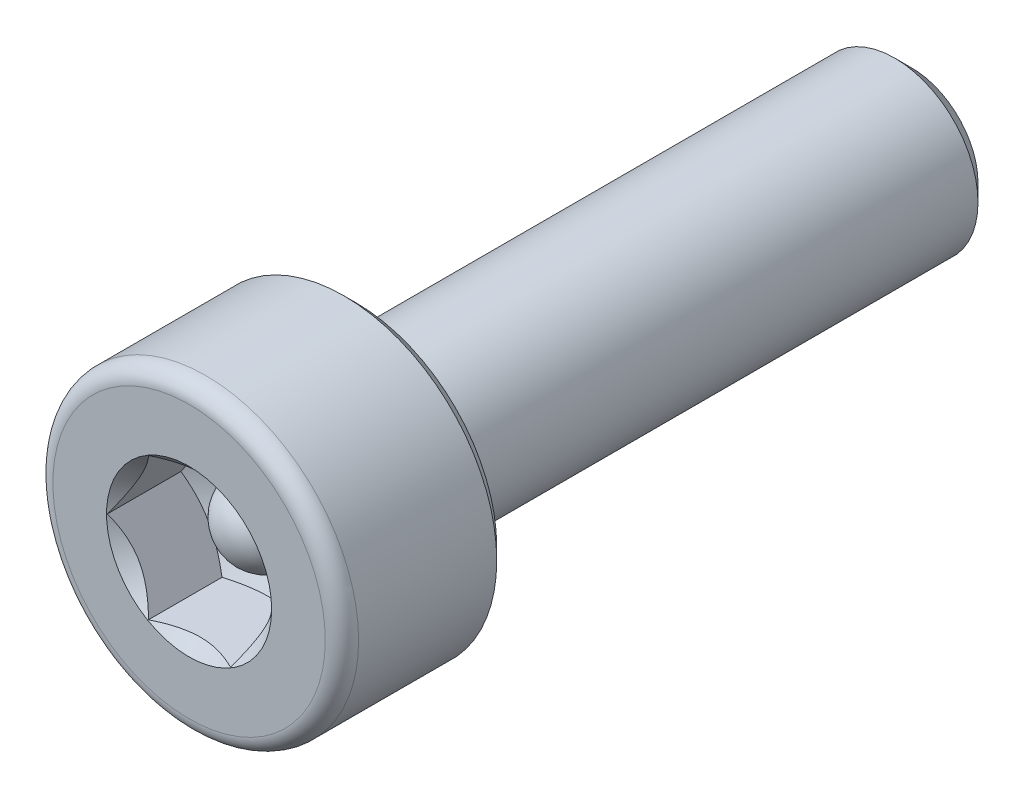
ISO-10303-21;
HEADER;
FILE_DESCRIPTION(('STEP AP214'),'2;1');
FILE_NAME('part.step','',(''),(''),'','','');
FILE_SCHEMA(('AUTOMOTIVE_DESIGN { 1 0 10303 214 1 1 1 1 }'));
ENDSEC;
DATA;
#1=APPLICATION_CONTEXT('core data for automotive mechanical design processes');
#2=APPLICATION_PROTOCOL_DEFINITION('international standard','automotive_design',2000,#1);
#3=PRODUCT_CONTEXT('',#1,'mechanical');
#4=PRODUCT('Part','Part','',(#3));
#5=PRODUCT_RELATED_PRODUCT_CATEGORY('part','',(#4));
#6=PRODUCT_DEFINITION_FORMATION('','',#4);
#7=PRODUCT_DEFINITION_CONTEXT('part definition',#1,'design');
#8=PRODUCT_DEFINITION('design','',#6,#7);
#9=PRODUCT_DEFINITION_SHAPE('','',#8);
#10=(LENGTH_UNIT() NAMED_UNIT(*) SI_UNIT(.MILLI.,.METRE.));
#11=(NAMED_UNIT(*) PLANE_ANGLE_UNIT() SI_UNIT($,.RADIAN.));
#12=(NAMED_UNIT(*) SI_UNIT($,.STERADIAN.) SOLID_ANGLE_UNIT());
#13=UNCERTAINTY_MEASURE_WITH_UNIT(LENGTH_MEASURE(1.E-05),#10,'distance_accuracy_value','');
#14=(GEOMETRIC_REPRESENTATION_CONTEXT(3) GLOBAL_UNCERTAINTY_ASSIGNED_CONTEXT((#13)) GLOBAL_UNIT_ASSIGNED_CONTEXT((#10,
#11,#12)) REPRESENTATION_CONTEXT('',''));
#15=CARTESIAN_POINT('',(0.,0.,0.));
#16=DIRECTION('',(0.,0.,1.));
#17=DIRECTION('',(1.,0.,0.));
#18=AXIS2_PLACEMENT_3D('',#15,#16,#17);
#19=CARTESIAN_POINT('',(0.,0.,1.615850938766));
#20=DIRECTION('',(1.,0.,0.));
#21=DIRECTION('',(0.,-1.,0.));
#22=AXIS2_PLACEMENT_3D('',#19,#20,#21);
#23=SPHERICAL_SURFACE('',#22,0.739008344563);
#24=CARTESIAN_POINT('',(0.739008344562999,0.,1.615850938766));
#25=VERTEX_POINT('',#24);
#26=VERTEX_LOOP('',#25);
#27=FACE_BOUND('',#26,.T.);
#28=CARTESIAN_POINT('',(-0.739008344563001,0.,1.615850938766));
#29=VERTEX_POINT('',#28);
#30=VERTEX_LOOP('',#29);
#31=FACE_BOUND('',#30,.T.);
#32=ADVANCED_FACE('P0_F16',(#27,#31),#23,.T.);
#33=CLOSED_SHELL('',(#32));
#34=MANIFOLD_SOLID_BREP('P0_B1',#33);
#35=CARTESIAN_POINT('',(0.,0.,-0.1));
#36=DIRECTION('',(0.,0.,-1.));
#37=DIRECTION('',(-1.,0.,0.));
#38=AXIS2_PLACEMENT_3D('',#35,#36,#37);
#39=CYLINDRICAL_SURFACE('',#38,1.5);
#40=CARTESIAN_POINT('',(0.,0.,-9.693282669493));
#41=DIRECTION('',(0.,0.,-1.));
#42=DIRECTION('',(-1.,0.,0.));
#43=AXIS2_PLACEMENT_3D('',#40,#41,#42);
#44=CIRCLE('',#43,1.5);
#45=CARTESIAN_POINT('',(-1.5,0.,-9.693282669493));
#46=VERTEX_POINT('',#45);
#47=EDGE_CURVE('P1_E30',#46,#46,#44,.F.);
#48=ORIENTED_EDGE('',*,*,#47,.T.);
#49=EDGE_LOOP('',(#48));
#50=FACE_BOUND('',#49,.T.);
#51=CARTESIAN_POINT('',(0.,0.,-0.1));
#52=DIRECTION('',(0.,0.,-1.));
#53=DIRECTION('',(-1.,0.,0.));
#54=AXIS2_PLACEMENT_3D('',#51,#52,#53);
#55=CIRCLE('',#54,1.5);
#56=CARTESIAN_POINT('',(-1.5,0.,-0.1));
#57=VERTEX_POINT('',#56);
#58=EDGE_CURVE('P1_E11',#57,#57,#55,.T.);
#59=ORIENTED_EDGE('',*,*,#58,.T.);
#60=EDGE_LOOP('',(#59));
#61=FACE_BOUND('',#60,.T.);
#62=ADVANCED_FACE('P1_F17',(#50,#61),#39,.T.);
#63=CARTESIAN_POINT('',(0.,0.,-0.1));
#64=DIRECTION('',(0.,0.,-1.));
#65=DIRECTION('',(1.,0.,0.));
#66=AXIS2_PLACEMENT_3D('',#63,#64,#65);
#67=TOROIDAL_SURFACE('',#66,1.6,0.1);
#68=ORIENTED_EDGE('',*,*,#58,.F.);
#69=EDGE_LOOP('',(#68));
#70=FACE_BOUND('',#69,.T.);
#71=CARTESIAN_POINT('',(0.,0.,0.));
#72=DIRECTION('',(0.,0.,-1.));
#73=DIRECTION('',(1.,0.,0.));
#74=AXIS2_PLACEMENT_3D('',#71,#72,#73);
#75=CIRCLE('',#74,1.6);
#76=CARTESIAN_POINT('',(1.6,0.,0.));
#77=VERTEX_POINT('',#76);
#78=EDGE_CURVE('P1_E123',#77,#77,#75,.F.);
#79=ORIENTED_EDGE('',*,*,#78,.F.);
#80=EDGE_LOOP('',(#79));
#81=FACE_BOUND('',#80,.T.);
#82=ADVANCED_FACE('P1_F287',(#70,#81),#67,.F.);
#83=CARTESIAN_POINT('',(0.,0.,-9.69328266961611));
#84=DIRECTION('',(0.,0.,1.));
#85=DIRECTION('',(1.,0.,0.));
#86=AXIS2_PLACEMENT_3D('',#83,#84,#85);
#87=CONICAL_SURFACE('',#86,1.49999999990769,0.785398163397448);
#88=CARTESIAN_POINT('',(0.,0.,-9.99999999999091));
#89=DIRECTION('',(0.,0.,1.));
#90=DIRECTION('',(1.,0.,0.));
#91=AXIS2_PLACEMENT_3D('',#88,#89,#90);
#92=CIRCLE('',#91,1.19328266953289);
#93=CARTESIAN_POINT('',(1.19328266953289,0.,-9.99999999999091));
#94=VERTEX_POINT('',#93);
#95=EDGE_CURVE('P1_E120',#94,#94,#92,.T.);
#96=ORIENTED_EDGE('',*,*,#95,.T.);
#97=EDGE_LOOP('',(#96));
#98=FACE_BOUND('',#97,.T.);
#99=ORIENTED_EDGE('',*,*,#47,.F.);
#100=EDGE_LOOP('',(#99));
#101=FACE_BOUND('',#100,.T.);
#102=ADVANCED_FACE('P1_F279',(#98,#101),#87,.T.);
#103=CARTESIAN_POINT('',(0.,0.,0.));
#104=DIRECTION('',(0.,0.,1.));
#105=DIRECTION('',(1.,0.,0.));
#106=AXIS2_PLACEMENT_3D('',#103,#104,#105);
#107=PLANE('',#106);
#108=ORIENTED_EDGE('',*,*,#78,.T.);
#109=EDGE_LOOP('',(#108));
#110=FACE_BOUND('',#109,.T.);
#111=CARTESIAN_POINT('',(0.,0.,0.));
#112=DIRECTION('',(0.,0.,1.));
#113=DIRECTION('',(1.,0.,0.));
#114=AXIS2_PLACEMENT_3D('',#111,#112,#113);
#115=CIRCLE('',#114,2.5349999999662);
#116=CARTESIAN_POINT('',(2.5349999999662,0.,0.));
#117=VERTEX_POINT('',#116);
#118=EDGE_CURVE('P1_E124',#117,#117,#115,.T.);
#119=ORIENTED_EDGE('',*,*,#118,.F.);
#120=EDGE_LOOP('',(#119));
#121=FACE_BOUND('',#120,.T.);
#122=ADVANCED_FACE('P1_F271',(#110,#121),#107,.F.);
#123=CARTESIAN_POINT('',(0.,0.,-10.));
#124=DIRECTION('',(0.,0.,1.));
#125=DIRECTION('',(1.,0.,0.));
#126=AXIS2_PLACEMENT_3D('',#123,#124,#125);
#127=PLANE('',#126);
#128=ORIENTED_EDGE('',*,*,#95,.F.);
#129=EDGE_LOOP('',(#128));
#130=FACE_BOUND('',#129,.T.);
#131=ADVANCED_FACE('P1_F263',(#130),#127,.F.);
#132=CARTESIAN_POINT('',(0.,0.,0.215000000025611));
#133=DIRECTION('',(0.,0.,1.));
#134=DIRECTION('',(1.,0.,0.));
#135=AXIS2_PLACEMENT_3D('',#132,#133,#134);
#136=CONICAL_SURFACE('',#135,2.74999999993497,0.785398163265254);
#137=ORIENTED_EDGE('',*,*,#118,.T.);
#138=EDGE_LOOP('',(#137));
#139=FACE_BOUND('',#138,.T.);
#140=CARTESIAN_POINT('',(0.,0.,0.215000000025611));
#141=DIRECTION('',(0.,0.,1.));
#142=DIRECTION('',(1.,0.,0.));
#143=AXIS2_PLACEMENT_3D('',#140,#141,#142);
#144=CIRCLE('',#143,2.74999999993497);
#145=CARTESIAN_POINT('',(2.74999999993497,0.,0.215000000025611));
#146=VERTEX_POINT('',#145);
#147=EDGE_CURVE('P1_E127',#146,#146,#144,.F.);
#148=ORIENTED_EDGE('',*,*,#147,.T.);
#149=EDGE_LOOP('',(#148));
#150=FACE_BOUND('',#149,.T.);
#151=ADVANCED_FACE('P1_F255',(#139,#150),#136,.T.);
#152=CARTESIAN_POINT('',(0.,0.,2.7));
#153=DIRECTION('',(0.,0.,-1.));
#154=DIRECTION('',(-1.,0.,0.));
#155=AXIS2_PLACEMENT_3D('',#152,#153,#154);
#156=CYLINDRICAL_SURFACE('',#155,2.75);
#157=ORIENTED_EDGE('',*,*,#147,.F.);
#158=EDGE_LOOP('',(#157));
#159=FACE_BOUND('',#158,.T.);
#160=CARTESIAN_POINT('',(0.,0.,2.7));
#161=DIRECTION('',(0.,0.,-1.));
#162=DIRECTION('',(-1.,0.,0.));
#163=AXIS2_PLACEMENT_3D('',#160,#161,#162);
#164=CIRCLE('',#163,2.75);
#165=CARTESIAN_POINT('',(-2.75,0.,2.7));
#166=VERTEX_POINT('',#165);
#167=EDGE_CURVE('P1_E434',#166,#166,#164,.T.);
#168=ORIENTED_EDGE('',*,*,#167,.T.);
#169=EDGE_LOOP('',(#168));
#170=FACE_BOUND('',#169,.T.);
#171=ADVANCED_FACE('P1_F248',(#159,#170),#156,.T.);
#172=CARTESIAN_POINT('',(0.,0.,2.7));
#173=DIRECTION('',(0.,0.,-1.));
#174=DIRECTION('',(1.,0.,0.));
#175=AXIS2_PLACEMENT_3D('',#172,#173,#174);
#176=TOROIDAL_SURFACE('',#175,2.45,0.3);
#177=ORIENTED_EDGE('',*,*,#167,.F.);
#178=EDGE_LOOP('',(#177));
#179=FACE_BOUND('',#178,.T.);
#180=CARTESIAN_POINT('',(0.,0.,3.));
#181=DIRECTION('',(0.,0.,-1.));
#182=DIRECTION('',(1.,0.,0.));
#183=AXIS2_PLACEMENT_3D('',#180,#181,#182);
#184=CIRCLE('',#183,2.45);
#185=CARTESIAN_POINT('',(2.45,0.,3.));
#186=VERTEX_POINT('',#185);
#187=EDGE_CURVE('P1_E131',#186,#186,#184,.F.);
#188=ORIENTED_EDGE('',*,*,#187,.F.);
#189=EDGE_LOOP('',(#188));
#190=FACE_BOUND('',#189,.T.);
#191=ADVANCED_FACE('P1_F241',(#179,#190),#176,.T.);
#192=CARTESIAN_POINT('',(0.,0.,3.));
#193=DIRECTION('',(0.,0.,1.));
#194=DIRECTION('',(1.,0.,0.));
#195=AXIS2_PLACEMENT_3D('',#192,#193,#194);
#196=PLANE('',#195);
#197=ORIENTED_EDGE('',*,*,#187,.T.);
#198=EDGE_LOOP('',(#197));
#199=FACE_BOUND('',#198,.T.);
#200=CARTESIAN_POINT('',(0.,0.,2.9999999999859));
#201=DIRECTION('',(0.,0.,1.));
#202=DIRECTION('',(1.,0.,0.));
#203=AXIS2_PLACEMENT_3D('',#200,#201,#202);
#204=CIRCLE('',#203,1.4854439087344);
#205=CARTESIAN_POINT('',(1.4854439087344,0.,2.9999999999859));
#206=VERTEX_POINT('',#205);
#207=EDGE_CURVE('P1_E128',#206,#206,#204,.F.);
#208=ORIENTED_EDGE('',*,*,#207,.T.);
#209=EDGE_LOOP('',(#208));
#210=FACE_BOUND('',#209,.T.);
#211=ADVANCED_FACE('P1_F150',(#199,#210),#196,.T.);
#212=CARTESIAN_POINT('',(0.,0.,2.9999999999859));
#213=DIRECTION('',(0.,0.,1.));
#214=DIRECTION('',(1.,0.,0.));
#215=AXIS2_PLACEMENT_3D('',#212,#213,#214);
#216=CONICAL_SURFACE('',#215,1.4854439087344,0.785398163397448);
#217=ORIENTED_EDGE('',*,*,#207,.F.);
#218=EDGE_LOOP('',(#217));
#219=FACE_BOUND('',#218,.T.);
#220=CARTESIAN_POINT('',(-0.73900833039765,1.28000002453511,2.99257279454244));
#221=CARTESIAN_POINT('',(-0.764408407762743,1.23600580002261,2.96719708967992));
#222=CARTESIAN_POINT('',(-0.790233176713147,1.1912759881068,2.94331199094595));
#223=CARTESIAN_POINT('',(-0.842892530835464,1.10006731127323,2.89957939484165));
#224=CARTESIAN_POINT('',(-0.869732121178957,1.05357977714399,2.87975622232529));
#225=CARTESIAN_POINT('',(-0.923852835173947,0.959839950762814,2.84579898979231));
#226=CARTESIAN_POINT('',(-0.951120183396313,0.912611518254027,2.83157960268337));
#227=CARTESIAN_POINT('',(-1.0062550176399,0.817115184077292,2.80967194523321));
#228=CARTESIAN_POINT('',(-1.03412082054732,0.768850197647962,2.80196732772804));
#229=CARTESIAN_POINT('',(-1.08215006859365,0.685661099782431,2.79501535623299));
#230=CARTESIAN_POINT('',(-1.10225153047865,0.650844346491229,2.79398660559318));
#231=CARTESIAN_POINT('',(-1.14241907185677,0.581272124009232,2.79572259922399));
#232=CARTESIAN_POINT('',(-1.16248514255375,0.546516670053808,2.79848818146684));
#233=CARTESIAN_POINT('',(-1.20242355510745,0.477341310337187,2.80765297004438));
#234=CARTESIAN_POINT('',(-1.22229569931528,0.442921746913913,2.814055555235));
#235=CARTESIAN_POINT('',(-1.26170819927281,0.374657294534199,2.83014952360517));
#236=CARTESIAN_POINT('',(-1.28124840886902,0.340812658723032,2.83984231799677));
#237=CARTESIAN_POINT('',(-1.3312711614295,0.254170709753885,2.86859538704998));
#238=CARTESIAN_POINT('',(-1.3614389218517,0.201918615952088,2.88981369969133));
#239=CARTESIAN_POINT('',(-1.42059417461341,0.0994587126342785,2.93760802816772));
#240=CARTESIAN_POINT('',(-1.44958514902605,0.0492448719906812,2.9641666033907));
#241=CARTESIAN_POINT('',(-1.47801665262797,6.32166031965428E-08,2.99257274387948));
#242=B_SPLINE_CURVE_WITH_KNOTS('',3,(#220,#221,#222,#223,#224,#225,#226,#227,#228,#229,#230,
#231,#232,#233,#234,#235,#236,#237,#238,#239,#240,#241),.UNSPECIFIED.,.F.,.F.,(4,2,2,2,2,2,2,2,
2,2,4),(0.,0.170474178045342,0.341941186072123,0.510685878115575,0.679005880861947,
0.799483496257406,0.919987723220984,1.04060408478872,1.16127224573515,1.35282268707442,
1.54375742347498),.UNSPECIFIED.);
#243=CARTESIAN_POINT('',(-0.739008307823175,1.28,2.99257276200718));
#244=VERTEX_POINT('',#243);
#245=CARTESIAN_POINT('',(-1.47801667075188,3.18241214037053E-08,2.99257276200339));
#246=VERTEX_POINT('',#245);
#247=EDGE_CURVE('P1_E39',#244,#246,#242,.T.);
#248=ORIENTED_EDGE('',*,*,#247,.F.);
#249=CARTESIAN_POINT('',(0.739008272408615,1.28000000611594,2.99257274094721));
#250=CARTESIAN_POINT('',(0.68820812271924,1.28000000220067,2.96719704334762));
#251=CARTESIAN_POINT('',(0.636558590484336,1.28000000059091,2.94331195077126));
#252=CARTESIAN_POINT('',(0.531239894532556,1.27999999940565,2.89957936559875));
#253=CARTESIAN_POINT('',(0.477560720480202,1.27999999984207,2.87975619784138));
#254=CARTESIAN_POINT('',(0.36931930596067,1.28000000015542,2.8457989740032));
#255=CARTESIAN_POINT('',(0.314784616340694,1.28000000004114,2.83157959085405));
#256=CARTESIAN_POINT('',(0.204514962005421,1.27999999995897,2.80967193977415));
#257=CARTESIAN_POINT('',(0.148783363515357,1.27999999999072,2.80196732468796));
#258=CARTESIAN_POINT('',(0.0527248750780999,1.28000000000665,2.7950153553539));
#259=CARTESIAN_POINT('',(0.0125219515476332,1.28000000000178,2.79398660539414));
#260=CARTESIAN_POINT('',(-0.0678131306698073,1.27999999999822,2.79572260032543));
#261=CARTESIAN_POINT('',(-0.107945271764466,1.27999999999952,2.79848818318913));
#262=CARTESIAN_POINT('',(-0.187822096259196,1.28000000000048,2.80765297292113));
#263=CARTESIAN_POINT('',(-0.22756638436111,1.28000000000013,2.8140555586481));
#264=CARTESIAN_POINT('',(-0.306391383623089,1.27999999999987,2.83014952798809));
#265=CARTESIAN_POINT('',(-0.34547180247616,1.27999999999996,2.83984232281309));
#266=CARTESIAN_POINT('',(-0.445517304080994,1.28000000000007,2.86859539209757));
#267=CARTESIAN_POINT('',(-0.505852821834525,1.28000000000004,2.88981370415139));
#268=CARTESIAN_POINT('',(-0.624163321317431,1.27999999999997,2.93760803081388));
#269=CARTESIAN_POINT('',(-0.682145267195326,1.27999999999993,2.96416660480513));
#270=CARTESIAN_POINT('',(-0.73900827158237,1.28,2.99257274388677));
#271=B_SPLINE_CURVE_WITH_KNOTS('',3,(#249,#250,#251,#252,#253,#254,#255,#256,#257,#258,#259,
#260,#261,#262,#263,#264,#265,#266,#267,#268,#269,#270),.UNSPECIFIED.,.F.,.F.,(4,2,2,2,2,2,2,2,
2,2,4),(0.,0.170474154921732,0.341941139416435,0.510685808711831,0.67900578888861,
0.799483403509877,0.919987629713269,1.04060399061425,1.16127215089305,1.35282258295896,
1.54375730985654),.UNSPECIFIED.);
#272=CARTESIAN_POINT('',(0.739008337482733,1.28000001226243,2.99257278745653));
#273=VERTEX_POINT('',#272);
#274=EDGE_CURVE('P1_E165',#273,#244,#271,.T.);
#275=ORIENTED_EDGE('',*,*,#274,.F.);
#276=CARTESIAN_POINT('',(1.47801667853174,1.8348056452837E-08,2.99257276978325));
#277=CARTESIAN_POINT('',(1.45261660259499,0.0439942403865967,2.96719706761263));
#278=CARTESIAN_POINT('',(1.42679183511048,0.0887240497634091,2.94331197153223));
#279=CARTESIAN_POINT('',(1.37413248406308,0.179932721271055,2.89957938050909));
#280=CARTESIAN_POINT('',(1.34729289533023,0.22642025261058,2.87975621041389));
#281=CARTESIAN_POINT('',(1.29317218473374,0.320160073105395,2.84579898225533));
#282=CARTESIAN_POINT('',(1.26590483829921,0.367388502517553,2.83157959709392));
#283=CARTESIAN_POINT('',(1.21077000774575,0.462884830302805,2.80967194275167));
#284=CARTESIAN_POINT('',(1.18290420673992,0.511149813438468,2.80196732641222));
#285=CARTESIAN_POINT('',(1.13487496071501,0.594338907802801,2.7950153558772));
#286=CARTESIAN_POINT('',(1.11477349892741,0.629155660925311,2.79398660551534));
#287=CARTESIAN_POINT('',(1.07460595775605,0.698727883049188,2.79572259966083));
#288=CARTESIAN_POINT('',(1.05453988716844,0.733483336815178,2.7984881821405));
#289=CARTESIAN_POINT('',(1.01460147479739,0.802658696215434,2.80765297114743));
#290=CARTESIAN_POINT('',(0.994729330663319,0.83707825951096,2.81405555653851));
#291=CARTESIAN_POINT('',(0.95531683085651,0.905342711629617,2.83014952526765));
#292=CARTESIAN_POINT('',(0.935776621337286,0.939187347307438,2.83984231981792));
#293=CARTESIAN_POINT('',(0.885753860349397,1.02582931087329,2.86859539417931));
#294=CARTESIAN_POINT('',(0.855586091716678,1.07808141889612,2.88981371394575));
#295=CARTESIAN_POINT('',(0.79643082320749,1.18054134948936,2.93760805912835));
#296=CARTESIAN_POINT('',(0.767439841253865,1.23075520319432,2.9641666439137));
#297=CARTESIAN_POINT('',(0.739008330402467,1.28000002452487,2.99257279453598));
#298=B_SPLINE_CURVE_WITH_KNOTS('',3,(#276,#277,#278,#279,#280,#281,#282,#283,#284,#285,#286,
#287,#288,#289,#290,#291,#292,#293,#294,#295,#296,#297),.UNSPECIFIED.,.F.,.F.,(4,2,2,2,2,2,2,2,
2,2,4),(0.,0.170474166745543,0.341941163208503,0.510685843446508,0.679005834505186,
0.799483449295666,0.919987675657461,1.040604036887,1.16127219750169,1.35282269216248,
1.54375748133644),.UNSPECIFIED.);
#299=CARTESIAN_POINT('',(1.47801667853205,-4.26931163012623E-13,2.99257276978355));
#300=VERTEX_POINT('',#299);
#301=EDGE_CURVE('P1_E171',#300,#273,#298,.T.);
#302=ORIENTED_EDGE('',*,*,#301,.F.);
#303=CARTESIAN_POINT('',(0.739008330397649,-1.28000002453511,2.99257279454244));
#304=CARTESIAN_POINT('',(0.764408407784721,-1.23600579998454,2.96719708965798));
#305=CARTESIAN_POINT('',(0.790233176757962,-1.19127598802918,2.94331199090453));
#306=CARTESIAN_POINT('',(0.842892530927419,-1.10006731111396,2.89957939476955));
#307=CARTESIAN_POINT('',(0.869732121295217,-1.05357977694262,2.87975622224202));
#308=CARTESIAN_POINT('',(0.923852835292992,-0.959839950556622,2.84579898972774));
#309=CARTESIAN_POINT('',(0.951120183492341,-0.912611518087702,2.83157960263935));
#310=CARTESIAN_POINT('',(1.00625501768864,-0.817115183992872,2.80967194521967));
#311=CARTESIAN_POINT('',(1.0341208205718,-0.768850197605566,2.80196732772449));
#312=CARTESIAN_POINT('',(1.08215006858505,-0.685661099797333,2.79501535623424));
#313=CARTESIAN_POINT('',(1.10225153046139,-0.650844346521124,2.79398660559405));
#314=CARTESIAN_POINT('',(1.14241907182218,-0.581272124069146,2.79572259922089));
#315=CARTESIAN_POINT('',(1.16248514251048,-0.546516670128749,2.79848818146012));
#316=CARTESIAN_POINT('',(1.20242355506417,-0.477341310412151,2.80765297003123));
#317=CARTESIAN_POINT('',(1.22229569928048,-0.442921746974185,2.81405555522214));
#318=CARTESIAN_POINT('',(1.26170819925536,-0.374657294564425,2.83014952359669));
#319=CARTESIAN_POINT('',(1.28124840886042,-0.340812658737923,2.83984231799251));
#320=CARTESIAN_POINT('',(1.33127116608195,-0.254170701695606,2.86859538972313));
#321=CARTESIAN_POINT('',(1.36143893099818,-0.201918600109919,2.8898137061194));
#322=CARTESIAN_POINT('',(1.42059419239467,-0.0994586818362376,2.9376080434876));
#323=CARTESIAN_POINT('',(1.44958517094973,-0.0492448340177649,2.96416662383977));
#324=CARTESIAN_POINT('',(1.47801667853235,-1.83489103127095E-08,2.99257276978385));
#325=B_SPLINE_CURVE_WITH_KNOTS('',3,(#303,#304,#305,#306,#307,#308,#309,#310,#311,#312,#313,
#314,#315,#316,#317,#318,#319,#320,#321,#322,#323,#324),.UNSPECIFIED.,.F.,.F.,(4,2,2,2,2,2,2,2,
2,2,4),(0.,0.170474178193379,0.341941186367866,0.510685878262845,0.679005880862119,
0.799483496205901,0.919987723117028,1.04060408473501,1.16127224573534,1.35282271611339,
1.54375748134627),.UNSPECIFIED.);
#326=CARTESIAN_POINT('',(0.739008307823175,-1.28,2.99257276200718));
#327=VERTEX_POINT('',#326);
#328=EDGE_CURVE('P1_E95',#327,#300,#325,.T.);
#329=ORIENTED_EDGE('',*,*,#328,.F.);
#330=CARTESIAN_POINT('',(-0.739008372896817,-1.28,2.992572794544));
#331=CARTESIAN_POINT('',(-0.688208218166412,-1.28,2.96719708968126));
#332=CARTESIAN_POINT('',(-0.636558680265379,-1.28,2.94331199094707));
#333=CARTESIAN_POINT('',(-0.531239972020271,-1.28,2.89957939484235));
#334=CARTESIAN_POINT('',(-0.477560791333038,-1.28,2.87975622232579));
#335=CARTESIAN_POINT('',(-0.369319363342575,-1.28,2.84579898979247));
#336=CARTESIAN_POINT('',(-0.314784666897609,-1.28,2.83157960268339));
#337=CARTESIAN_POINT('',(-0.204514998409949,-1.28,2.809671945233));
#338=CARTESIAN_POINT('',(-0.148783392594856,-1.28,2.80196732772774));
#339=CARTESIAN_POINT('',(-0.0527248965019611,-1.28,2.79501535623261));
#340=CARTESIAN_POINT('',(-0.0125219727319928,-1.28,2.79398660559278));
#341=CARTESIAN_POINT('',(0.0678131100242131,-1.28,2.79572259922355));
#342=CARTESIAN_POINT('',(0.107945251418159,-1.28,2.79848818146638));
#343=CARTESIAN_POINT('',(0.187822076525534,-1.28,2.80765297004388));
#344=CARTESIAN_POINT('',(0.227566364941179,-1.28,2.81405555523448));
#345=CARTESIAN_POINT('',(0.306391364856226,-1.28,2.83014952360461));
#346=CARTESIAN_POINT('',(0.345471784048643,-1.28,2.8398423179962));
#347=CARTESIAN_POINT('',(0.445517289172431,-1.28,2.8685953870502));
#348=CARTESIAN_POINT('',(0.505852810019585,-1.28,2.88981369969269));
#349=CARTESIAN_POINT('',(0.624163315548283,-1.28,2.93760802817177));
#350=CARTESIAN_POINT('',(0.682145264376097,-1.28,2.96416660339633));
#351=CARTESIAN_POINT('',(0.73900827158237,-1.28,2.99257274388678));
#352=B_SPLINE_CURVE_WITH_KNOTS('',3,(#330,#331,#332,#333,#334,#335,#336,#337,#338,#339,#340,
#341,#342,#343,#344,#345,#346,#347,#348,#349,#350,#351),.UNSPECIFIED.,.F.,.F.,(4,2,2,2,2,2,2,2,
2,2,4),(0.,0.17047417804628,0.34194118607402,0.510685878118316,0.679005880865523,
0.79948349626097,0.919987723224535,1.04060408479228,1.16127224573873,1.35282268708692,
1.54375742349635),.UNSPECIFIED.);
#353=CARTESIAN_POINT('',(-0.739008362932853,-1.27999996818058,2.99257276200559));
#354=VERTEX_POINT('',#353);
#355=EDGE_CURVE('P1_E93',#354,#327,#352,.T.);
#356=ORIENTED_EDGE('',*,*,#355,.F.);
#357=CARTESIAN_POINT('',(-1.47801670328417,2.45243962858423E-08,2.99257279453567));
#358=CARTESIAN_POINT('',(-1.45261662591942,-0.0439941999874958,2.9671970896738));
#359=CARTESIAN_POINT('',(-1.42679185696938,-0.0887240119026779,2.94331199094046));
#360=CARTESIAN_POINT('',(-1.37413250284782,-0.179932688734942,2.89957939483736));
#361=CARTESIAN_POINT('',(-1.34729291250472,-0.2264202228635,2.87975622232157));
#362=CARTESIAN_POINT('',(-1.29317219851055,-0.320160049243261,2.84579898978961));
#363=CARTESIAN_POINT('',(-1.2659048502886,-0.367388481751312,2.83157960268112));
#364=CARTESIAN_POINT('',(-1.21077001604589,-0.46288481592653,2.80967194523168));
#365=CARTESIAN_POINT('',(-1.18290421313892,-0.51114980235508,2.80196732772679));
#366=CARTESIAN_POINT('',(-1.13487496509308,-0.594338900219759,2.79501535623196));
#367=CARTESIAN_POINT('',(-1.11477350320812,-0.6291556535109,2.79398660559221));
#368=CARTESIAN_POINT('',(-1.07460596183007,-0.69872787599277,2.79572259922314));
#369=CARTESIAN_POINT('',(-1.05453989113313,-0.733483329948128,2.79848818146604));
#370=CARTESIAN_POINT('',(-1.0146014785795,-0.802658689664625,2.80765297004368));
#371=CARTESIAN_POINT('',(-0.994729334371709,-0.83707825308784,2.81405555523434));
#372=CARTESIAN_POINT('',(-0.955316834414246,-0.905342705467438,2.83014952360457));
#373=CARTESIAN_POINT('',(-0.935776624818068,-0.939187341278546,2.83984231799621));
#374=CARTESIAN_POINT('',(-0.885753872256689,-1.02582929024926,2.86859538705004));
#375=CARTESIAN_POINT('',(-0.855586111833581,-1.07808138405262,2.88981369969221));
#376=CARTESIAN_POINT('',(-0.796430859070142,-1.18054128737342,2.9376080281705));
#377=CARTESIAN_POINT('',(-0.767439884656675,-1.23075512801845,2.96416660339456));
#378=CARTESIAN_POINT('',(-0.739008381053962,-1.2799999367939,2.99257274388448));
#379=B_SPLINE_CURVE_WITH_KNOTS('',3,(#357,#358,#359,#360,#361,#362,#363,#364,#365,#366,#367,
#368,#369,#370,#371,#372,#373,#374,#375,#376,#377,#378),.UNSPECIFIED.,.F.,.F.,(4,2,2,2,2,2,2,2,
2,2,4),(0.,0.170474178042596,0.341941186066571,0.510685878107226,0.679005880850828,
0.79948349624607,0.919987723209432,1.04060408477699,1.16127224572325,1.35282268706842,
1.54375742347479),.UNSPECIFIED.);
#380=EDGE_CURVE('P1_E91',#246,#354,#379,.T.);
#381=ORIENTED_EDGE('',*,*,#380,.F.);
#382=EDGE_LOOP('',(#248,#275,#302,#329,#356,#381));
#383=FACE_BOUND('',#382,.T.);
#384=ADVANCED_FACE('P1_F146',(#219,#383),#216,.F.);
#385=CARTESIAN_POINT('',(-1.478016689125,0.,4.));
#386=DIRECTION('',(-0.866025403784329,-0.50000000000019,0.));
#387=DIRECTION('',(0.50000000000019,-0.866025403784329,0.));
#388=AXIS2_PLACEMENT_3D('',#385,#386,#387);
#389=PLANE('',#388);
#390=CARTESIAN_POINT('',(-1.47801668912927,7.40140874405819E-12,1.66821187995555));
#391=CARTESIAN_POINT('',(-1.44543422538176,-0.056434482639037,1.64869441099508));
#392=CARTESIAN_POINT('',(-1.41254915183333,-0.113393100835532,1.63093697134104));
#393=CARTESIAN_POINT('',(-1.3461645207857,-0.22837465465167,1.59995007271958));
#394=CARTESIAN_POINT('',(-1.31266357555924,-0.286399993885459,1.58673263572));
#395=CARTESIAN_POINT('',(-1.24610867453935,-0.401676463944573,1.56622424110573));
#396=CARTESIAN_POINT('',(-1.2130665937308,-0.458907026692746,1.55878475304555));
#397=CARTESIAN_POINT('',(-1.14681860473037,-0.573651909540697,1.5499903879319));
#398=CARTESIAN_POINT('',(-1.1136129775487,-0.631165742916505,1.54862731922389));
#399=CARTESIAN_POINT('',(-1.05184366410041,-0.738153332157539,1.55186320695229));
#400=CARTESIAN_POINT('',(-1.02326863836162,-0.787646728564677,1.55566923535866));
#401=CARTESIAN_POINT('',(-0.966319631082127,-0.886285302613328,1.56759997183643));
#402=CARTESIAN_POINT('',(-0.937945879656263,-0.935430081684229,1.57572900305517));
#403=CARTESIAN_POINT('',(-0.88087388118021,-1.0342816827342,1.59600087659475));
#404=CARTESIAN_POINT('',(-0.852183896751241,-1.08397419343351,1.60823433680883));
#405=CARTESIAN_POINT('',(-0.795260914250543,-1.18256769124302,1.63595418834019));
#406=CARTESIAN_POINT('',(-0.767027075163526,-1.23147013503443,1.6514336171397));
#407=CARTESIAN_POINT('',(-0.739008344558036,-1.2800000000067,1.66821187995533));
#408=B_SPLINE_CURVE_WITH_KNOTS('',3,(#390,#391,#392,#393,#394,#395,#396,#397,#398,#399,#400,
#401,#402,#403,#404,#405,#406,#407),.UNSPECIFIED.,.F.,.F.,(4,2,2,2,2,2,2,2,4),(0.,
0.204164271419993,0.408865077483372,0.608111505081253,0.807089246080722,0.978746004979672,
1.15057475007757,1.32647851521597,1.5020087617587),.UNSPECIFIED.);
#409=CARTESIAN_POINT('',(-1.47801668912744,-3.27435413642058E-12,1.66821187995446));
#410=VERTEX_POINT('',#409);
#411=CARTESIAN_POINT('',(-0.739008344564367,-1.28000000000335,1.66821187995549));
#412=VERTEX_POINT('',#411);
#413=EDGE_CURVE('P1_E72',#410,#412,#408,.T.);
#414=ORIENTED_EDGE('',*,*,#413,.F.);
#415=DIRECTION('',(0.,0.,1.));
#416=VECTOR('',#415,1.);
#417=CARTESIAN_POINT('',(-1.478016689125,0.,4.));
#418=LINE('',#417,#416);
#419=EDGE_CURVE('P1_E80',#246,#410,#418,.F.);
#420=ORIENTED_EDGE('',*,*,#419,.F.);
#421=ORIENTED_EDGE('',*,*,#380,.T.);
#422=DIRECTION('',(0.,0.,1.));
#423=VECTOR('',#422,1.);
#424=CARTESIAN_POINT('',(-0.739008344562178,-1.27999999999953,4.));
#425=LINE('',#424,#423);
#426=EDGE_CURVE('P1_E79',#412,#354,#425,.T.);
#427=ORIENTED_EDGE('',*,*,#426,.F.);
#428=EDGE_LOOP('',(#414,#420,#421,#427));
#429=FACE_BOUND('',#428,.T.);
#430=ADVANCED_FACE('P1_F89',(#429),#389,.F.);
#431=CARTESIAN_POINT('',(-0.739008344563,1.28,4.));
#432=DIRECTION('',(-0.866025403784329,0.50000000000019,0.));
#433=DIRECTION('',(-0.50000000000019,-0.866025403784329,0.));
#434=AXIS2_PLACEMENT_3D('',#431,#432,#433);
#435=PLANE('',#434);
#436=CARTESIAN_POINT('',(-0.739008344558926,1.28000000000706,1.66821187995578));
#437=CARTESIAN_POINT('',(-0.771590808306453,1.2235655173606,1.64869441099533));
#438=CARTESIAN_POINT('',(-0.804475881854898,1.16660689916408,1.63093697134131));
#439=CARTESIAN_POINT('',(-0.870860512902545,1.0516253453479,1.59995007271991));
#440=CARTESIAN_POINT('',(-0.904361458129021,0.99360000611409,1.58673263572036));
#441=CARTESIAN_POINT('',(-0.970916359148938,0.878323536054935,1.56622424110616));
#442=CARTESIAN_POINT('',(-1.0039584399575,0.821092973306742,1.55878475304601));
#443=CARTESIAN_POINT('',(-1.07020642895795,0.706348090458752,1.54999038793243));
#444=CARTESIAN_POINT('',(-1.10341205613963,0.648834257082926,1.54862731922445));
#445=CARTESIAN_POINT('',(-1.16518136958789,0.541846667841935,1.55186320695292));
#446=CARTESIAN_POINT('',(-1.19375639532664,0.492353271434858,1.55566923535931));
#447=CARTESIAN_POINT('',(-1.25070540260607,0.393714697386329,1.56759997183711));
#448=CARTESIAN_POINT('',(-1.2790791540319,0.344569918315489,1.57572900305584));
#449=CARTESIAN_POINT('',(-1.33615115250788,0.245718317265646,1.59600087659542));
#450=CARTESIAN_POINT('',(-1.36484113693681,0.1960258065664,1.60823433680949));
#451=CARTESIAN_POINT('',(-1.42176411943744,0.0974323087570127,1.63595418834082));
#452=CARTESIAN_POINT('',(-1.44999795852442,0.0485298649656598,1.65143361714031));
#453=CARTESIAN_POINT('',(-1.47801668912988,-6.54871701998737E-12,1.66821187995592));
#454=B_SPLINE_CURVE_WITH_KNOTS('',3,(#436,#437,#438,#439,#440,#441,#442,#443,#444,#445,#446,
#447,#448,#449,#450,#451,#452,#453),.UNSPECIFIED.,.F.,.F.,(4,2,2,2,2,2,2,2,4),(0.,
0.204164271420047,0.408865077483478,0.608111505081419,0.807089246080946,0.978746004979693,
1.15057475007739,1.32647851521556,1.50200876175807),.UNSPECIFIED.);
#455=CARTESIAN_POINT('',(-0.739008344567075,1.28,1.66821187995456));
#456=VERTEX_POINT('',#455);
#457=EDGE_CURVE('P1_E76',#456,#410,#454,.T.);
#458=ORIENTED_EDGE('',*,*,#457,.F.);
#459=DIRECTION('',(0.,0.,1.));
#460=VECTOR('',#459,1.);
#461=CARTESIAN_POINT('',(-0.739008344563,1.28,4.));
#462=LINE('',#461,#460);
#463=EDGE_CURVE('P1_E104',#244,#456,#462,.F.);
#464=ORIENTED_EDGE('',*,*,#463,.F.);
#465=ORIENTED_EDGE('',*,*,#247,.T.);
#466=ORIENTED_EDGE('',*,*,#419,.T.);
#467=EDGE_LOOP('',(#458,#464,#465,#466));
#468=FACE_BOUND('',#467,.T.);
#469=ADVANCED_FACE('P1_F210',(#468),#435,.F.);
#470=CARTESIAN_POINT('',(0.739008344563,1.28,4.));
#471=DIRECTION('',(0.,1.,0.));
#472=DIRECTION('',(-1.,0.,0.));
#473=AXIS2_PLACEMENT_3D('',#470,#471,#472);
#474=PLANE('',#473);
#475=CARTESIAN_POINT('',(0.739008344570848,1.28,1.66821187995569));
#476=CARTESIAN_POINT('',(0.673843417075827,1.28,1.64869441099523));
#477=CARTESIAN_POINT('',(0.608073269978973,1.28,1.6309369713412));
#478=CARTESIAN_POINT('',(0.47530400788375,1.28,1.59995007271978));
#479=CARTESIAN_POINT('',(0.408302117430832,1.28,1.58673263572021));
#480=CARTESIAN_POINT('',(0.275192315391068,1.28,1.56622424110598));
#481=CARTESIAN_POINT('',(0.209108153773983,1.28,1.55878475304582));
#482=CARTESIAN_POINT('',(0.0766121757731468,1.28,1.5499903879322));
#483=CARTESIAN_POINT('',(0.0102009214098262,1.28,1.54862731922421));
#484=CARTESIAN_POINT('',(-0.113337705486716,1.28,1.55186320695265));
#485=CARTESIAN_POINT('',(-0.170487756964257,1.28,1.55566923535904));
#486=CARTESIAN_POINT('',(-0.284385771523198,1.28,1.56759997183683));
#487=CARTESIAN_POINT('',(-0.341133274374897,1.28,1.57572900305558));
#488=CARTESIAN_POINT('',(-0.455277271326946,1.28,1.59600087659518));
#489=CARTESIAN_POINT('',(-0.512657240184855,1.28,1.60823433680927));
#490=CARTESIAN_POINT('',(-0.626503205186192,1.28,1.63595418834064));
#491=CARTESIAN_POINT('',(-0.682970883360198,1.28,1.65143361714015));
#492=CARTESIAN_POINT('',(-0.739008344571149,1.28,1.66821187995578));
#493=B_SPLINE_CURVE_WITH_KNOTS('',3,(#475,#476,#477,#478,#479,#480,#481,#482,#483,#484,#485,
#486,#487,#488,#489,#490,#491,#492),.UNSPECIFIED.,.F.,.F.,(4,2,2,2,2,2,2,2,4),(0.,
0.204164271420026,0.408865077483437,0.608111505081353,0.807089246080857,0.978746004979793,
1.15057475007768,1.32647851521606,1.50200876175877),.UNSPECIFIED.);
#494=CARTESIAN_POINT('',(0.739008344560518,1.28000000000335,1.66821187995434));
#495=VERTEX_POINT('',#494);
#496=EDGE_CURVE('P1_E107',#495,#456,#493,.T.);
#497=ORIENTED_EDGE('',*,*,#496,.F.);
#498=DIRECTION('',(0.,0.,1.));
#499=VECTOR('',#498,1.);
#500=CARTESIAN_POINT('',(0.739008344563,1.28,4.));
#501=LINE('',#500,#499);
#502=EDGE_CURVE('P1_E108',#273,#495,#501,.F.);
#503=ORIENTED_EDGE('',*,*,#502,.F.);
#504=ORIENTED_EDGE('',*,*,#274,.T.);
#505=ORIENTED_EDGE('',*,*,#463,.T.);
#506=EDGE_LOOP('',(#497,#503,#504,#505));
#507=FACE_BOUND('',#506,.T.);
#508=ADVANCED_FACE('P1_F181',(#507),#474,.F.);
#509=CARTESIAN_POINT('',(1.478016689125,0.,4.));
#510=DIRECTION('',(0.866025403784329,0.50000000000019,0.));
#511=DIRECTION('',(-0.50000000000019,0.866025403784329,0.));
#512=AXIS2_PLACEMENT_3D('',#509,#510,#511);
#513=PLANE('',#512);
#514=CARTESIAN_POINT('',(1.47801668354993,9.65630103245288E-09,1.66821187661432));
#515=CARTESIAN_POINT('',(1.44543421989276,0.0564344921462542,1.64869440792664));
#516=CARTESIAN_POINT('',(1.4125491464352,0.113393110185369,1.63093696856329));
#517=CARTESIAN_POINT('',(1.34616451557906,0.228374663669848,1.59995007054716));
#518=CARTESIAN_POINT('',(1.31266357045328,0.286400002729241,1.58673263386181));
#519=CARTESIAN_POINT('',(1.2461086696346,0.401676472439841,1.56622423987106));
#520=CARTESIAN_POINT('',(1.21306658892615,0.458907035014633,1.55878475212147));
#521=CARTESIAN_POINT('',(1.14681860013883,0.573651917493482,1.54999038760769));
#522=CARTESIAN_POINT('',(1.11361297307013,0.631165750673613,1.54862731918921));
#523=CARTESIAN_POINT('',(1.05184366009665,0.738153339092246,1.55186320739498));
#524=CARTESIAN_POINT('',(1.02326863471753,0.78764673487643,1.55566923595509));
#525=CARTESIAN_POINT('',(0.966319628158504,0.886285307677192,1.56759997261617));
#526=CARTESIAN_POINT('',(0.937945877093436,0.935430086123176,1.57572900386416));
#527=CARTESIAN_POINT('',(0.880873879352612,1.03428168589969,1.59600087734782));
#528=CARTESIAN_POINT('',(0.852183895297763,1.083974195951,1.60823433747246));
#529=CARTESIAN_POINT('',(0.79526091353296,1.18256769248591,1.63595418873373));
#530=CARTESIAN_POINT('',(0.767027074807761,1.23147013565064,1.65143361735298));
#531=CARTESIAN_POINT('',(0.739008344558036,1.2800000000067,1.66821187995533));
#532=B_SPLINE_CURVE_WITH_KNOTS('',3,(#514,#515,#516,#517,#518,#519,#520,#521,#522,#523,#524,
#525,#526,#527,#528,#529,#530,#531),.UNSPECIFIED.,.F.,.F.,(4,2,2,2,2,2,2,2,4),(0.,
0.204164270664747,0.40886507595116,0.608111502847713,0.807089243153975,0.978745999938187,
1.15057474291246,1.32647850580417,1.50200875011583),.UNSPECIFIED.);
#533=CARTESIAN_POINT('',(1.47801668633781,-4.82850064795515E-09,1.66821187828387));
#534=VERTEX_POINT('',#533);
#535=EDGE_CURVE('P1_E111',#534,#495,#532,.T.);
#536=ORIENTED_EDGE('',*,*,#535,.F.);
#537=DIRECTION('',(0.,0.,1.));
#538=VECTOR('',#537,1.);
#539=CARTESIAN_POINT('',(1.478016689125,0.,4.));
#540=LINE('',#539,#538);
#541=EDGE_CURVE('P1_E112',#300,#534,#540,.F.);
#542=ORIENTED_EDGE('',*,*,#541,.F.);
#543=ORIENTED_EDGE('',*,*,#301,.T.);
#544=ORIENTED_EDGE('',*,*,#502,.T.);
#545=EDGE_LOOP('',(#536,#542,#543,#544));
#546=FACE_BOUND('',#545,.T.);
#547=ADVANCED_FACE('P1_F177',(#546),#513,.F.);
#548=CARTESIAN_POINT('',(0.739008344563,-1.28,4.));
#549=DIRECTION('',(0.866025403784329,-0.50000000000019,0.));
#550=DIRECTION('',(0.50000000000019,0.866025403784329,0.));
#551=AXIS2_PLACEMENT_3D('',#548,#549,#550);
#552=PLANE('',#551);
#553=CARTESIAN_POINT('',(0.739008344558925,-1.28000000000706,1.66821187995578));
#554=CARTESIAN_POINT('',(0.771590808304517,-1.22356551736395,1.64869441099648));
#555=CARTESIAN_POINT('',(0.804475881851,-1.16660689917083,1.63093697134341));
#556=CARTESIAN_POINT('',(0.870860512894406,-1.051625345362,1.59995007272343));
#557=CARTESIAN_POINT('',(0.904361458118599,-0.993600006132141,1.58673263572431));
#558=CARTESIAN_POINT('',(0.97091635913816,-0.878323536073603,1.56622424110876));
#559=CARTESIAN_POINT('',(1.0039584399487,-0.821092973321974,1.55878475304754));
#560=CARTESIAN_POINT('',(1.07020642895349,-0.706348090466472,1.54999038793266));
#561=CARTESIAN_POINT('',(1.10341205613752,-0.648834257086568,1.5486273192245));
#562=CARTESIAN_POINT('',(1.1651813691162,-0.541846668658933,1.55186320692807));
#563=CARTESIAN_POINT('',(1.19375639438416,-0.492353273067288,1.55566923523334));
#564=CARTESIAN_POINT('',(1.25070540073041,-0.393714700635074,1.56759997137258));
#565=CARTESIAN_POINT('',(1.27907915169387,-0.34456992236508,1.57572900235355));
#566=CARTESIAN_POINT('',(1.33615114923363,-0.245718322936807,1.59600087530095));
#567=CARTESIAN_POINT('',(1.36484113318925,-0.196025813057378,1.60823433515609));
#568=CARTESIAN_POINT('',(1.42176411476156,-0.0974323168558693,1.63595418589259));
#569=CARTESIAN_POINT('',(1.44999795339349,-0.0485298738527019,1.65143361425668));
#570=CARTESIAN_POINT('',(1.47801668355062,-9.65700133099165E-09,1.66821187661474));
#571=B_SPLINE_CURVE_WITH_KNOTS('',3,(#553,#554,#555,#556,#557,#558,#559,#560,#561,#562,#563,
#564,#565,#566,#567,#568,#569,#570),.UNSPECIFIED.,.F.,.F.,(4,2,2,2,2,2,2,2,4),(0.,
0.204164271407957,0.408865077457716,0.608111505067952,0.80708924608094,0.978746002150112,
1.15057474440697,1.32647850654676,1.50200875011541),.UNSPECIFIED.);
#572=CARTESIAN_POINT('',(0.739008344567075,-1.28,1.66821187995456));
#573=VERTEX_POINT('',#572);
#574=EDGE_CURVE('P1_E115',#573,#534,#571,.T.);
#575=ORIENTED_EDGE('',*,*,#574,.F.);
#576=DIRECTION('',(0.,0.,1.));
#577=VECTOR('',#576,1.);
#578=CARTESIAN_POINT('',(0.739008344563,-1.28,4.));
#579=LINE('',#578,#577);
#580=EDGE_CURVE('P1_E86',#327,#573,#579,.F.);
#581=ORIENTED_EDGE('',*,*,#580,.F.);
#582=ORIENTED_EDGE('',*,*,#328,.T.);
#583=ORIENTED_EDGE('',*,*,#541,.T.);
#584=EDGE_LOOP('',(#575,#581,#582,#583));
#585=FACE_BOUND('',#584,.T.);
#586=ADVANCED_FACE('P1_F180',(#585),#552,.F.);
#587=CARTESIAN_POINT('',(-0.739008344563,-1.28,4.));
#588=DIRECTION('',(0.,-1.,0.));
#589=DIRECTION('',(1.,0.,0.));
#590=AXIS2_PLACEMENT_3D('',#587,#588,#589);
#591=PLANE('',#590);
#592=CARTESIAN_POINT('',(-0.739008344570697,-1.28,1.66821187995565));
#593=CARTESIAN_POINT('',(-0.673843417075679,-1.28,1.64869441099519));
#594=CARTESIAN_POINT('',(-0.608073269978827,-1.28,1.63093697134116));
#595=CARTESIAN_POINT('',(-0.475304007883609,-1.28,1.59995007271975));
#596=CARTESIAN_POINT('',(-0.408302117430694,-1.28,1.58673263572018));
#597=CARTESIAN_POINT('',(-0.275192315390935,-1.28,1.56622424110596));
#598=CARTESIAN_POINT('',(-0.209108153773853,-1.28,1.55878475304581));
#599=CARTESIAN_POINT('',(-0.0766121757730228,-1.28,1.5499903879322));
#600=CARTESIAN_POINT('',(-0.0102009214097053,-1.28,1.54862731922421));
#601=CARTESIAN_POINT('',(0.113337705486824,-1.28,1.55186320695266));
#602=CARTESIAN_POINT('',(0.170487756964356,-1.28,1.55566923535905));
#603=CARTESIAN_POINT('',(0.284385771523277,-1.28,1.56759997183685));
#604=CARTESIAN_POINT('',(0.341133274374966,-1.28,1.57572900305559));
#605=CARTESIAN_POINT('',(0.455277271326995,-1.28,1.59600087659519));
#606=CARTESIAN_POINT('',(0.512657240184894,-1.28,1.60823433680927));
#607=CARTESIAN_POINT('',(0.626503205186211,-1.28,1.63595418834065));
#608=CARTESIAN_POINT('',(0.682970883360208,-1.28,1.65143361714015));
#609=CARTESIAN_POINT('',(0.739008344571149,-1.28,1.66821187995578));
#610=B_SPLINE_CURVE_WITH_KNOTS('',3,(#592,#593,#594,#595,#596,#597,#598,#599,#600,#601,#602,
#603,#604,#605,#606,#607,#608,#609),.UNSPECIFIED.,.F.,.F.,(4,2,2,2,2,2,2,2,4),(0.,
0.204164271420016,0.408865077483416,0.608111505081324,0.807089246080817,0.978746004979726,
1.15057475007758,1.32647851521593,1.50200876175861),.UNSPECIFIED.);
#611=EDGE_CURVE('P1_E21',#412,#573,#610,.T.);
#612=ORIENTED_EDGE('',*,*,#611,.F.);
#613=ORIENTED_EDGE('',*,*,#426,.T.);
#614=ORIENTED_EDGE('',*,*,#355,.T.);
#615=ORIENTED_EDGE('',*,*,#580,.T.);
#616=EDGE_LOOP('',(#612,#613,#614,#615));
#617=FACE_BOUND('',#616,.T.);
#618=ADVANCED_FACE('P1_F83',(#617),#591,.F.);
#619=CARTESIAN_POINT('',(0.,0.,1.67278614298993));
#620=DIRECTION('',(0.,0.,1.));
#621=DIRECTION('',(1.,0.,0.));
#622=AXIS2_PLACEMENT_3D('',#619,#620,#621);
#623=CONICAL_SURFACE('',#622,1.4856550048421,1.03121728665649);
#624=CARTESIAN_POINT('',(0.,0.,0.905834687614515));
#625=DIRECTION('',(0.,0.,1.));
#626=DIRECTION('',(1.,0.,0.));
#627=AXIS2_PLACEMENT_3D('',#624,#625,#626);
#628=CIRCLE('',#627,0.204964036925048);
#629=CARTESIAN_POINT('',(0.204964036925048,0.,0.905834687614515));
#630=VERTEX_POINT('',#629);
#631=EDGE_CURVE('P1_E88',#630,#630,#628,.T.);
#632=ORIENTED_EDGE('',*,*,#631,.F.);
#633=EDGE_LOOP('',(#632));
#634=FACE_BOUND('',#633,.T.);
#635=ORIENTED_EDGE('',*,*,#574,.T.);
#636=ORIENTED_EDGE('',*,*,#535,.T.);
#637=ORIENTED_EDGE('',*,*,#496,.T.);
#638=ORIENTED_EDGE('',*,*,#457,.T.);
#639=ORIENTED_EDGE('',*,*,#413,.T.);
#640=ORIENTED_EDGE('',*,*,#611,.T.);
#641=EDGE_LOOP('',(#635,#636,#637,#638,#639,#640));
#642=FACE_BOUND('',#641,.T.);
#643=ADVANCED_FACE('P1_F18',(#634,#642),#623,.F.);
#644=OPEN_SHELL('',(#62,#82,#102,#122,#131,#151,#171,#191,#211,#384,#430,#469,#508,#547,#586,
#618,#643));
#645=SHELL_BASED_SURFACE_MODEL('P1_B1',(#644));
#646=ADVANCED_BREP_SHAPE_REPRESENTATION('',(#18,#34),#14);
#647=MANIFOLD_SURFACE_SHAPE_REPRESENTATION('',(#18,#645),#14);
#648=SHAPE_REPRESENTATION('',(#18),#14);
#649=SHAPE_DEFINITION_REPRESENTATION(#9,#648);
#650=SHAPE_REPRESENTATION_RELATIONSHIP('','',#648,#646);
#651=SHAPE_REPRESENTATION_RELATIONSHIP('','',#648,#647);
ENDSEC;
END-ISO-10303-21;
